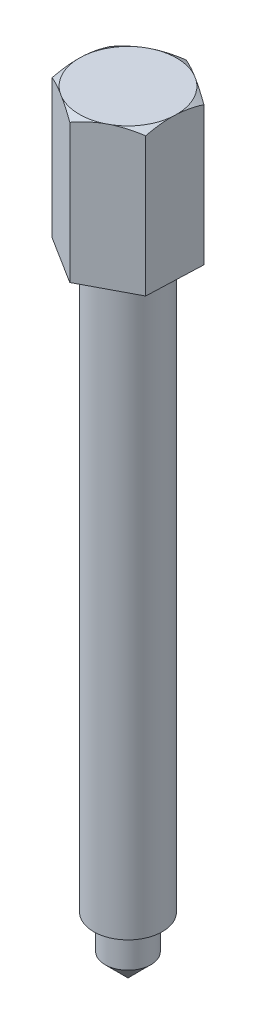
ISO-10303-21;
HEADER;
FILE_DESCRIPTION(('STEP AP214'),'2;1');
FILE_NAME('part.step','',(''),(''),'','','');
FILE_SCHEMA(('AUTOMOTIVE_DESIGN { 1 0 10303 214 1 1 1 1 }'));
ENDSEC;
DATA;
#1=APPLICATION_CONTEXT('core data for automotive mechanical design processes');
#2=APPLICATION_PROTOCOL_DEFINITION('international standard','automotive_design',2000,#1);
#3=PRODUCT_CONTEXT('',#1,'mechanical');
#4=PRODUCT('Part','Part','',(#3));
#5=PRODUCT_RELATED_PRODUCT_CATEGORY('part','',(#4));
#6=PRODUCT_DEFINITION_FORMATION('','',#4);
#7=PRODUCT_DEFINITION_CONTEXT('part definition',#1,'design');
#8=PRODUCT_DEFINITION('design','',#6,#7);
#9=PRODUCT_DEFINITION_SHAPE('','',#8);
#10=(LENGTH_UNIT() NAMED_UNIT(*) SI_UNIT(.MILLI.,.METRE.));
#11=(NAMED_UNIT(*) PLANE_ANGLE_UNIT() SI_UNIT($,.RADIAN.));
#12=(NAMED_UNIT(*) SI_UNIT($,.STERADIAN.) SOLID_ANGLE_UNIT());
#13=UNCERTAINTY_MEASURE_WITH_UNIT(LENGTH_MEASURE(1.E-05),#10,'distance_accuracy_value','');
#14=(GEOMETRIC_REPRESENTATION_CONTEXT(3) GLOBAL_UNCERTAINTY_ASSIGNED_CONTEXT((#13)) GLOBAL_UNIT_ASSIGNED_CONTEXT((#10,
#11,#12)) REPRESENTATION_CONTEXT('',''));
#15=CARTESIAN_POINT('',(0.,0.,0.));
#16=DIRECTION('',(0.,0.,1.));
#17=DIRECTION('',(1.,0.,0.));
#18=AXIS2_PLACEMENT_3D('',#15,#16,#17);
#19=CARTESIAN_POINT('',(0.,-110.,0.));
#20=DIRECTION('',(0.,1.,0.));
#21=DIRECTION('',(0.,0.,1.));
#22=AXIS2_PLACEMENT_3D('',#19,#20,#21);
#23=CONICAL_SURFACE('',#22,0.,0.785398163397444);
#24=CARTESIAN_POINT('',(0.,-106.,0.));
#25=DIRECTION('',(0.,1.,0.));
#26=DIRECTION('',(0.,0.,1.));
#27=AXIS2_PLACEMENT_3D('',#24,#25,#26);
#28=CIRCLE('',#27,4.00000000000001);
#29=CARTESIAN_POINT('',(0.,-106.,4.00000000000001));
#30=VERTEX_POINT('',#29);
#31=EDGE_CURVE('E135',#30,#30,#28,.T.);
#32=ORIENTED_EDGE('',*,*,#31,.F.);
#33=EDGE_LOOP('',(#32));
#34=FACE_BOUND('',#33,.T.);
#35=CARTESIAN_POINT('',(0.,-110.,0.));
#36=VERTEX_POINT('',#35);
#37=VERTEX_LOOP('',#36);
#38=FACE_BOUND('',#37,.T.);
#39=ADVANCED_FACE('F35',(#34,#38),#23,.T.);
#40=CARTESIAN_POINT('',(0.,0.,0.));
#41=DIRECTION('',(0.,1.,0.));
#42=DIRECTION('',(0.,0.,1.));
#43=AXIS2_PLACEMENT_3D('',#40,#41,#42);
#44=CYLINDRICAL_SURFACE('',#43,4.00000000000001);
#45=CARTESIAN_POINT('',(0.,-100.,0.));
#46=DIRECTION('',(0.,1.,0.));
#47=DIRECTION('',(0.,0.,1.));
#48=AXIS2_PLACEMENT_3D('',#45,#46,#47);
#49=CIRCLE('',#48,4.00000000000001);
#50=CARTESIAN_POINT('',(0.,-100.,4.00000000000001));
#51=VERTEX_POINT('',#50);
#52=EDGE_CURVE('E188',#51,#51,#49,.T.);
#53=ORIENTED_EDGE('',*,*,#52,.F.);
#54=EDGE_LOOP('',(#53));
#55=FACE_BOUND('',#54,.T.);
#56=ORIENTED_EDGE('',*,*,#31,.T.);
#57=EDGE_LOOP('',(#56));
#58=FACE_BOUND('',#57,.T.);
#59=ADVANCED_FACE('F193',(#55,#58),#44,.T.);
#60=CARTESIAN_POINT('',(4.00000000000001,-100.,0.));
#61=DIRECTION('',(0.,1.,0.));
#62=DIRECTION('',(0.,0.,1.));
#63=AXIS2_PLACEMENT_3D('',#60,#61,#62);
#64=PLANE('',#63);
#65=CARTESIAN_POINT('',(0.,-100.,0.));
#66=DIRECTION('',(0.,1.,0.));
#67=DIRECTION('',(0.,0.,1.));
#68=AXIS2_PLACEMENT_3D('',#65,#66,#67);
#69=CIRCLE('',#68,6.);
#70=CARTESIAN_POINT('',(0.,-100.,6.));
#71=VERTEX_POINT('',#70);
#72=EDGE_CURVE('E185',#71,#71,#69,.T.);
#73=ORIENTED_EDGE('',*,*,#72,.F.);
#74=EDGE_LOOP('',(#73));
#75=FACE_BOUND('',#74,.T.);
#76=ORIENTED_EDGE('',*,*,#52,.T.);
#77=EDGE_LOOP('',(#76));
#78=FACE_BOUND('',#77,.T.);
#79=ADVANCED_FACE('F200',(#75,#78),#64,.F.);
#80=CARTESIAN_POINT('',(0.,0.,0.));
#81=DIRECTION('',(0.,1.,0.));
#82=DIRECTION('',(0.,0.,1.));
#83=AXIS2_PLACEMENT_3D('',#80,#81,#82);
#84=CYLINDRICAL_SURFACE('',#83,6.);
#85=CARTESIAN_POINT('',(0.,0.,0.));
#86=DIRECTION('',(0.,1.,0.));
#87=DIRECTION('',(0.,0.,1.));
#88=AXIS2_PLACEMENT_3D('',#85,#86,#87);
#89=CIRCLE('',#88,6.);
#90=CARTESIAN_POINT('',(0.,0.,6.));
#91=VERTEX_POINT('',#90);
#92=EDGE_CURVE('E182',#91,#91,#89,.T.);
#93=ORIENTED_EDGE('',*,*,#92,.F.);
#94=EDGE_LOOP('',(#93));
#95=FACE_BOUND('',#94,.T.);
#96=ORIENTED_EDGE('',*,*,#72,.T.);
#97=EDGE_LOOP('',(#96));
#98=FACE_BOUND('',#97,.T.);
#99=ADVANCED_FACE('F205',(#95,#98),#84,.T.);
#100=CARTESIAN_POINT('',(0.,0.,0.));
#101=DIRECTION('',(0.,1.,0.));
#102=DIRECTION('',(0.,0.,1.));
#103=AXIS2_PLACEMENT_3D('',#100,#101,#102);
#104=PLANE('',#103);
#105=DIRECTION('',(0.884127698716343,0.,-0.467245344934054));
#106=VECTOR('',#105,1.);
#107=CARTESIAN_POINT('',(-0.367251169301559,0.,9.80808135732876));
#108=LINE('',#107,#106);
#109=CARTESIAN_POINT('',(-0.367251169301559,0.,9.80808135732876));
#110=VERTEX_POINT('',#109);
#111=CARTESIAN_POINT('',(8.31042203318048,0.,5.22208952084907));
#112=VERTEX_POINT('',#111);
#113=EDGE_CURVE('E154',#110,#112,#108,.T.);
#114=ORIENTED_EDGE('',*,*,#113,.F.);
#115=DIRECTION('',(0.846710187871085,0.,0.5320543748108));
#116=VECTOR('',#115,1.);
#117=CARTESIAN_POINT('',(-8.67767320248205,0.,4.58599183647969));
#118=LINE('',#117,#116);
#119=CARTESIAN_POINT('',(-8.67767320248205,0.,4.58599183647969));
#120=VERTEX_POINT('',#119);
#121=EDGE_CURVE('E170',#120,#110,#118,.T.);
#122=ORIENTED_EDGE('',*,*,#121,.F.);
#123=DIRECTION('',(-0.0374175108452577,0.,0.999299719744855));
#124=VECTOR('',#123,1.);
#125=CARTESIAN_POINT('',(-8.31042203318049,0.,-5.22208952084907));
#126=LINE('',#125,#124);
#127=CARTESIAN_POINT('',(-8.31042203318049,0.,-5.22208952084907));
#128=VERTEX_POINT('',#127);
#129=EDGE_CURVE('E167',#128,#120,#126,.T.);
#130=ORIENTED_EDGE('',*,*,#129,.F.);
#131=DIRECTION('',(-0.884127698716343,0.,0.467245344934054));
#132=VECTOR('',#131,1.);
#133=CARTESIAN_POINT('',(0.36725116930156,0.,-9.80808135732876));
#134=LINE('',#133,#132);
#135=CARTESIAN_POINT('',(0.36725116930156,0.,-9.80808135732876));
#136=VERTEX_POINT('',#135);
#137=EDGE_CURVE('E164',#136,#128,#134,.T.);
#138=ORIENTED_EDGE('',*,*,#137,.F.);
#139=DIRECTION('',(-0.846710187871085,0.,-0.5320543748108));
#140=VECTOR('',#139,1.);
#141=CARTESIAN_POINT('',(8.67767320248205,0.,-4.58599183647969));
#142=LINE('',#141,#140);
#143=CARTESIAN_POINT('',(8.67767320248205,0.,-4.58599183647969));
#144=VERTEX_POINT('',#143);
#145=EDGE_CURVE('E161',#144,#136,#142,.T.);
#146=ORIENTED_EDGE('',*,*,#145,.F.);
#147=DIRECTION('',(0.0374175108452579,0.,-0.999299719744855));
#148=VECTOR('',#147,1.);
#149=CARTESIAN_POINT('',(8.31042203318048,0.,5.22208952084907));
#150=LINE('',#149,#148);
#151=EDGE_CURVE('E157',#112,#144,#150,.T.);
#152=ORIENTED_EDGE('',*,*,#151,.F.);
#153=EDGE_LOOP('',(#114,#122,#130,#138,#146,#152));
#154=FACE_BOUND('',#153,.T.);
#155=ORIENTED_EDGE('',*,*,#92,.T.);
#156=EDGE_LOOP('',(#155));
#157=FACE_BOUND('',#156,.T.);
#158=ADVANCED_FACE('F212',(#154,#157),#104,.F.);
#159=CARTESIAN_POINT('',(-0.367251169301559,25.,9.80808135732876));
#160=DIRECTION('',(-0.467245344934054,0.,-0.884127698716343));
#161=DIRECTION('',(-0.884127698716343,0.,0.467245344934054));
#162=AXIS2_PLACEMENT_3D('',#159,#160,#161);
#163=PLANE('',#162);
#164=DIRECTION('',(0.,-1.,0.));
#165=VECTOR('',#164,1.);
#166=CARTESIAN_POINT('',(8.31042203318048,25.,5.22208952084907));
#167=LINE('',#166,#165);
#168=CARTESIAN_POINT('',(8.31042203318048,24.2509679461587,5.22208952084907));
#169=VERTEX_POINT('',#168);
#170=EDGE_CURVE('E180',#169,#112,#167,.T.);
#171=ORIENTED_EDGE('',*,*,#170,.F.);
#172=CARTESIAN_POINT('',(14.23008146796,21.6134464981425,2.09365760031145));
#173=CARTESIAN_POINT('',(13.958045040196,21.7567201626429,2.2374238851024));
#174=CARTESIAN_POINT('',(13.6853472492561,21.8984125852793,2.38153968825556));
#175=CARTESIAN_POINT('',(13.138350068003,22.1778905995682,2.67061771058608));
#176=CARTESIAN_POINT('',(12.8640504735478,22.31567567954,2.81558003764877));
#177=CARTESIAN_POINT('',(12.3127278289662,22.5870066228706,3.1069439883671));
#178=CARTESIAN_POINT('',(12.0356987600788,22.7205368914338,3.253348792828));
#179=CARTESIAN_POINT('',(11.4795359966391,22.981854701103,3.54727065798408));
#180=CARTESIAN_POINT('',(11.2004023715816,23.1096424308725,3.6947876819525));
#181=CARTESIAN_POINT('',(10.632918518098,23.3612216467205,3.99469253647794));
#182=CARTESIAN_POINT('',(10.3445086310598,23.4848417964861,4.14711189552212));
#183=CARTESIAN_POINT('',(9.76475332902973,23.723036886835,4.4535019865324));
#184=CARTESIAN_POINT('',(9.47340777006291,23.8376113813312,4.6074727945866));
#185=CARTESIAN_POINT('',(8.8877328231352,24.0554790897805,4.91699130983477));
#186=CARTESIAN_POINT('',(8.59340675687992,24.1587836144598,5.07253726156799));
#187=CARTESIAN_POINT('',(8.00129983193139,24.3516767374282,5.38545495975468));
#188=CARTESIAN_POINT('',(7.70351943168274,24.4412671338927,5.54282646392856));
#189=CARTESIAN_POINT('',(6.98981299009566,24.6348673712812,5.92000728629753));
#190=CARTESIAN_POINT('',(6.57221182667769,24.7313104672817,6.14070187592456));
#191=CARTESIAN_POINT('',(5.94165225828948,24.8460498697153,6.47394109403839));
#192=CARTESIAN_POINT('',(5.73078344959806,24.8793078788088,6.58538140904708));
#193=CARTESIAN_POINT('',(5.3079141714548,24.9350074534465,6.80886010111264));
#194=CARTESIAN_POINT('',(5.0959137104453,24.9574490995691,6.92089847370789));
#195=CARTESIAN_POINT('',(4.67359518598364,24.9906721042974,7.14408610250928));
#196=CARTESIAN_POINT('',(4.46328505878661,25.0015819161049,7.2552311645495));
#197=CARTESIAN_POINT('',(4.04244497743081,25.0118602315472,7.47763746316525));
#198=CARTESIAN_POINT('',(3.83191502657274,25.0112289060522,7.58889869799643));
#199=CARTESIAN_POINT('',(3.41111373719411,24.9984426605916,7.81128449576057));
#200=CARTESIAN_POINT('',(3.20084242049154,24.9862868273571,7.92240904716314));
#201=CARTESIAN_POINT('',(2.78103858454432,24.9508175457841,8.1442677090019));
#202=CARTESIAN_POINT('',(2.57150609874195,24.9275035987556,8.25500180176448));
#203=CARTESIAN_POINT('',(2.07202145229629,24.8592101441147,8.51897031701019));
#204=CARTESIAN_POINT('',(1.78258955002146,24.809326531446,8.67192979244533));
#205=CARTESIAN_POINT('',(1.2065981237362,24.6915931282489,8.9763307438514));
#206=CARTESIAN_POINT('',(0.920039115418979,24.6237401700424,9.12777194728789));
#207=CARTESIAN_POINT('',(0.349829451423951,24.4726478890242,9.42911734289637));
#208=CARTESIAN_POINT('',(0.066182116230964,24.3893926993361,9.57901978025276));
#209=CARTESIAN_POINT('',(-0.497896061445979,24.2101012414723,9.87712479730074));
#210=CARTESIAN_POINT('',(-0.778327017331667,24.1140654254245,10.0253274369231));
#211=CARTESIAN_POINT('',(-1.33927291589172,23.9103488504353,10.321777101652));
#212=CARTESIAN_POINT('',(-1.61975433385269,23.8025508123706,10.4700064095598));
#213=CARTESIAN_POINT('',(-2.17794131701544,23.5781622705272,10.764998037878));
#214=CARTESIAN_POINT('',(-2.45564685698478,23.4615716869073,10.9117603449536));
#215=CARTESIAN_POINT('',(-3.00845401290608,23.221267833346,11.2039088328083));
#216=CARTESIAN_POINT('',(-3.28355696452987,23.0975584768077,11.3492957194656));
#217=CARTESIAN_POINT('',(-3.83162198360505,22.8442510833074,11.6389380745868));
#218=CARTESIAN_POINT('',(-4.10458409920174,22.7146531792208,11.7831935684946));
#219=CARTESIAN_POINT('',(-4.53768803813697,22.5044507540349,12.0120810919077));
#220=CARTESIAN_POINT('',(-4.69843176480083,22.4254253661981,12.0970312163299));
#221=CARTESIAN_POINT('',(-5.0193206199031,22.2658464340459,12.2666151169422));
#222=CARTESIAN_POINT('',(-5.17946576312877,22.1852929277835,12.3512489009472));
#223=CARTESIAN_POINT('',(-5.49777227070982,22.0235459722286,12.5194680780473));
#224=CARTESIAN_POINT('',(-5.65593851901029,21.9423648033225,12.6030560522182));
#225=CARTESIAN_POINT('',(-5.97178148510172,21.7787854513883,12.7699732926244));
#226=CARTESIAN_POINT('',(-6.12945819512396,21.6963872491647,12.853302554754));
#227=CARTESIAN_POINT('',(-6.28691060408106,21.6134464981425,12.9365132778664));
#228=B_SPLINE_CURVE_WITH_KNOTS('',3,(#172,#173,#174,#175,#176,#177,#178,#179,#180,#181,#182,
#183,#184,#185,#186,#187,#188,#189,#190,#191,#192,#193,#194,#195,#196,#197,#198,#199,#200,#201,
#202,#203,#204,#205,#206,#207,#208,#209,#210,#211,#212,#213,#214,#215,#216,#217,#218,#219,#220,
#221,#222,#223,#224,#225,#226,#227),.UNSPECIFIED.,.F.,.F.,(4,2,2,2,2,2,2,2,2,2,2,2,2,2,2,2,2,2,
2,2,2,2,2,2,2,2,2,4),(0.,1.01824471648429,2.03662216579151,3.05838099851981,4.08010623810476,
5.12653610938958,6.17301755323939,7.21843887711766,8.26372300931769,9.70833631858575,
10.4305705005381,11.1527993019994,11.8668955684394,12.5809812624648,13.2951235495162,
14.0092977567313,15.0021206417538,15.9951186605468,16.9891453881008,17.9831369602759,
18.9881464637671,19.9931650943948,20.997636418399,22.0020850876819,22.5968063520527,
23.1915128261642,23.7808680617845,24.3702326028542),.UNSPECIFIED.);
#229=CARTESIAN_POINT('',(4.45534998710913,25.,7.25942470503963));
#230=VERTEX_POINT('',#229);
#231=EDGE_CURVE('E229',#169,#230,#228,.T.);
#232=ORIENTED_EDGE('',*,*,#231,.T.);
#233=DIRECTION('',(0.884127698716343,0.,-0.467245344934054));
#234=VECTOR('',#233,1.);
#235=CARTESIAN_POINT('',(-0.367251169301559,25.,9.80808135732876));
#236=LINE('',#235,#234);
#237=CARTESIAN_POINT('',(3.48782087676979,25.,7.7707461731382));
#238=VERTEX_POINT('',#237);
#239=EDGE_CURVE('E171',#238,#230,#236,.T.);
#240=ORIENTED_EDGE('',*,*,#239,.F.);
#241=CARTESIAN_POINT('',(-0.367251169301493,24.2509679461587,9.8080813573288));
#242=VERTEX_POINT('',#241);
#243=EDGE_CURVE('E129',#238,#242,#228,.T.);
#244=ORIENTED_EDGE('',*,*,#243,.T.);
#245=DIRECTION('',(0.,-1.,0.));
#246=VECTOR('',#245,1.);
#247=CARTESIAN_POINT('',(-0.367251169301559,25.,9.80808135732876));
#248=LINE('',#247,#246);
#249=EDGE_CURVE('E142',#242,#110,#248,.T.);
#250=ORIENTED_EDGE('',*,*,#249,.T.);
#251=ORIENTED_EDGE('',*,*,#113,.T.);
#252=EDGE_LOOP('',(#171,#232,#240,#244,#250,#251));
#253=FACE_BOUND('',#252,.T.);
#254=ADVANCED_FACE('F214',(#253),#163,.F.);
#255=CARTESIAN_POINT('',(8.31042203318048,25.,5.22208952084907));
#256=DIRECTION('',(-0.999299719744855,0.,-0.0374175108452579));
#257=DIRECTION('',(-0.0374175108452579,0.,0.999299719744855));
#258=AXIS2_PLACEMENT_3D('',#255,#256,#257);
#259=PLANE('',#258);
#260=DIRECTION('',(0.,-1.,0.));
#261=VECTOR('',#260,1.);
#262=CARTESIAN_POINT('',(8.67767320248205,25.,-4.58599183647969));
#263=LINE('',#262,#261);
#264=CARTESIAN_POINT('',(8.67767320248205,24.2509679461587,-4.58599183647969));
#265=VERTEX_POINT('',#264);
#266=EDGE_CURVE('E178',#265,#144,#263,.T.);
#267=ORIENTED_EDGE('',*,*,#266,.F.);
#268=CARTESIAN_POINT('',(8.89932734360164,21.9684892541115,-10.5056512712592));
#269=CARTESIAN_POINT('',(8.8878330195287,22.1079755046752,-10.1986753510212));
#270=CARTESIAN_POINT('',(8.87630734672953,22.2456516422068,-9.89086220851374));
#271=CARTESIAN_POINT('',(8.85317987246457,22.5165057220498,-9.2732027750212));
#272=CARTESIAN_POINT('',(8.84157805773964,22.6496828546842,-8.96335612992761));
#273=CARTESIAN_POINT('',(8.81824063835403,22.9111519322656,-8.34008974676143));
#274=CARTESIAN_POINT('',(8.80650467823718,23.0394213036161,-8.02666051561333));
#275=CARTESIAN_POINT('',(8.78293378822296,23.2892748220069,-7.39715889315753));
#276=CARTESIAN_POINT('',(8.77109886288073,23.4108592748084,-7.08108662350276));
#277=CARTESIAN_POINT('',(8.74736688234484,23.6453460810252,-6.44728279842793));
#278=CARTESIAN_POINT('',(8.73547031817304,23.7582837533503,-6.1295643566008));
#279=CARTESIAN_POINT('',(8.71155019630785,23.9742323054342,-5.49073589003052));
#280=CARTESIAN_POINT('',(8.69952663236659,24.0772426942647,-5.16962569842754));
#281=CARTESIAN_POINT('',(8.6753585643771,24.2709843366448,-4.52417539927351));
#282=CARTESIAN_POINT('',(8.66321424669335,24.3617320717289,-4.19984026891017));
#283=CARTESIAN_POINT('',(8.63878378905808,24.5285444621306,-3.54738239780455));
#284=CARTESIAN_POINT('',(8.62649765526631,24.604609752653,-3.21925982156923));
#285=CARTESIAN_POINT('',(8.60529609412779,24.7201744686324,-2.65303524849445));
#286=CARTESIAN_POINT('',(8.59641310062015,24.7639257458191,-2.41579945375155));
#287=CARTESIAN_POINT('',(8.57858733591138,24.8414642205575,-1.9397313969696));
#288=CARTESIAN_POINT('',(8.56964457483535,24.8752530641578,-1.70089940533943));
#289=CARTESIAN_POINT('',(8.55171232537411,24.9319866136287,-1.22198748799891));
#290=CARTESIAN_POINT('',(8.54272284598787,24.954933334975,-0.981907802621919));
#291=CARTESIAN_POINT('',(8.52471286491765,24.989327519048,-0.500919927439193));
#292=CARTESIAN_POINT('',(8.51569236330971,25.0007750099461,-0.260011739664619));
#293=CARTESIAN_POINT('',(8.49764603945813,25.0118141243827,0.221946732717401));
#294=CARTESIAN_POINT('',(8.48862022281094,25.0114122195661,0.462996867861381));
#295=CARTESIAN_POINT('',(8.47058035455807,24.9987814645754,0.944782932249304));
#296=CARTESIAN_POINT('',(8.46156630289356,24.9865526737625,1.18551886306422));
#297=CARTESIAN_POINT('',(8.44356959354593,24.9506418567218,1.66615229380709));
#298=CARTESIAN_POINT('',(8.43458693888826,24.9269587558086,1.90604971293512));
#299=CARTESIAN_POINT('',(8.41667080933342,24.8688222428595,2.38453112013253));
#300=CARTESIAN_POINT('',(8.40773733650779,24.8343683806365,2.6231150528777));
#301=CARTESIAN_POINT('',(8.38541172355219,24.7355706926955,3.21935938516194));
#302=CARTESIAN_POINT('',(8.37205839120149,24.6649323009791,3.57598335544421));
#303=CARTESIAN_POINT('',(8.34551247310785,24.504640128335,4.28493827820888));
#304=CARTESIAN_POINT('',(8.3323199246886,24.4149820179255,4.6372682338972));
#305=CARTESIAN_POINT('',(8.30606900893404,24.2198580903541,5.33834460600163));
#306=CARTESIAN_POINT('',(8.29301101213571,24.1143570132263,5.68708112658341));
#307=CARTESIAN_POINT('',(8.2670497772868,23.8907217022373,6.38042106616491));
#308=CARTESIAN_POINT('',(8.25414652826015,23.7725883703323,6.72502477830008));
#309=CARTESIAN_POINT('',(8.22832619180969,23.5247259967195,7.41460178103986));
#310=CARTESIAN_POINT('',(8.2154107288238,23.3948768452057,7.75953168820437));
#311=CARTESIAN_POINT('',(8.18970113593146,23.12684226972,8.44615109157177));
#312=CARTESIAN_POINT('',(8.176907013807,22.9886563152106,8.78784037994355));
#313=CARTESIAN_POINT('',(8.15150398470814,22.7064851294293,9.46627246389853));
#314=CARTESIAN_POINT('',(8.13889441804817,22.5625421186309,9.80303287753268));
#315=CARTESIAN_POINT('',(8.11376692922506,22.2692678524223,10.474106179086));
#316=CARTESIAN_POINT('',(8.10124898498367,22.119937950204,10.8084196566427));
#317=CARTESIAN_POINT('',(8.08876789206089,21.9684892541115,11.1417489556286));
#318=B_SPLINE_CURVE_WITH_KNOTS('',3,(#268,#269,#270,#271,#272,#273,#274,#275,#276,#277,#278,
#279,#280,#281,#282,#283,#284,#285,#286,#287,#288,#289,#290,#291,#292,#293,#294,#295,#296,#297,
#298,#299,#300,#301,#302,#303,#304,#305,#306,#307,#308,#309,#310,#311,#312,#313,#314,#315,#316,
#317),.UNSPECIFIED.,.F.,.F.,(4,2,2,2,2,2,2,2,2,2,2,2,2,2,2,2,2,2,2,2,2,2,2,2,4),(0.,
1.01214454938079,2.02447029239928,3.04099827286971,4.05747971967174,5.06955913638856,
6.08168857722682,7.09244384681807,8.10315537842976,8.827171481499,9.55106789148689,
10.2748296811265,10.9985896976527,11.7219544340205,12.4453155397132,13.1687445269682,
13.8922037555309,14.9829299094317,16.0739046135937,17.1673443883906,18.2607061425103,
19.3669359774609,20.4732362850864,21.5725375088888,22.6715644843487),.UNSPECIFIED.);
#319=CARTESIAN_POINT('',(8.51452120497925,25.,-0.228733919067361));
#320=VERTEX_POINT('',#319);
#321=EDGE_CURVE('E262',#265,#320,#318,.T.);
#322=ORIENTED_EDGE('',*,*,#321,.T.);
#323=DIRECTION('',(0.0374175108452579,0.,-0.999299719744855));
#324=VECTOR('',#323,1.);
#325=CARTESIAN_POINT('',(8.31042203318048,25.,5.22208952084907));
#326=LINE('',#325,#324);
#327=CARTESIAN_POINT('',(8.47357403068328,25.,0.864831603436744));
#328=VERTEX_POINT('',#327);
#329=EDGE_CURVE('E311',#328,#320,#326,.T.);
#330=ORIENTED_EDGE('',*,*,#329,.F.);
#331=EDGE_CURVE('E228',#328,#169,#318,.T.);
#332=ORIENTED_EDGE('',*,*,#331,.T.);
#333=ORIENTED_EDGE('',*,*,#170,.T.);
#334=ORIENTED_EDGE('',*,*,#151,.T.);
#335=EDGE_LOOP('',(#267,#322,#330,#332,#333,#334));
#336=FACE_BOUND('',#335,.T.);
#337=ADVANCED_FACE('F218',(#336),#259,.F.);
#338=CARTESIAN_POINT('',(8.67767320248205,25.,-4.58599183647969));
#339=DIRECTION('',(-0.5320543748108,0.,0.846710187871085));
#340=DIRECTION('',(0.846710187871085,0.,0.5320543748108));
#341=AXIS2_PLACEMENT_3D('',#338,#339,#340);
#342=PLANE('',#341);
#343=DIRECTION('',(0.,-1.,0.));
#344=VECTOR('',#343,1.);
#345=CARTESIAN_POINT('',(0.36725116930156,25.,-9.80808135732876));
#346=LINE('',#345,#344);
#347=CARTESIAN_POINT('',(0.367251169301561,24.2509679461587,-9.80808135732876));
#348=VERTEX_POINT('',#347);
#349=EDGE_CURVE('E176',#348,#136,#346,.T.);
#350=ORIENTED_EDGE('',*,*,#349,.F.);
#351=CARTESIAN_POINT('',(-5.55240826547794,21.4750356314565,-13.5278673535072));
#352=CARTESIAN_POINT('',(-5.29033874593188,21.62041345735,-13.3631885337925));
#353=CARTESIAN_POINT('',(-5.02765633852324,21.764273030937,-13.1981245885965));
#354=CARTESIAN_POINT('',(-4.5008072311424,22.0482449318957,-12.8670640008505));
#355=CARTESIAN_POINT('',(-4.23664035887999,22.1883568129587,-12.701067250037));
#356=CARTESIAN_POINT('',(-3.7058155392685,22.464509314633,-12.3675084106866));
#357=CARTESIAN_POINT('',(-3.43915244483176,22.6005361767778,-12.1999430878311));
#358=CARTESIAN_POINT('',(-2.90386834084035,22.8670939639406,-11.8635821305933));
#359=CARTESIAN_POINT('',(-2.6352473907416,22.9976250550445,-11.6947865335718));
#360=CARTESIAN_POINT('',(-2.08840326737112,23.255443110169,-11.3511615101026));
#361=CARTESIAN_POINT('',(-1.8101174696176,23.3825456350892,-11.1762927317845));
#362=CARTESIAN_POINT('',(-1.25077587288653,23.6280365847303,-10.8248145662711));
#363=CARTESIAN_POINT('',(-0.969719941728916,23.7464245913232,-10.6482050960167));
#364=CARTESIAN_POINT('',(-0.404747467426367,23.9723114275291,-10.2931886087861));
#365=CARTESIAN_POINT('',(-0.120833796038275,24.0798201816409,-10.1147833963598));
#366=CARTESIAN_POINT('',(0.450325556905782,24.2815395507464,-9.75587920836125));
#367=CARTESIAN_POINT('',(0.737570815431541,24.3757518344889,-9.57538049861199));
#368=CARTESIAN_POINT('',(1.42240100845676,24.5797619365752,-9.14504801245432));
#369=CARTESIAN_POINT('',(1.82156291313143,24.6824685766403,-8.89422330208446));
#370=CARTESIAN_POINT('',(2.42454323078599,24.807580734689,-8.51532350788267));
#371=CARTESIAN_POINT('',(2.62624045685718,24.8444598836388,-8.38858133204066));
#372=CARTESIAN_POINT('',(3.03080776211526,24.9076586389953,-8.13435998481771));
#373=CARTESIAN_POINT('',(3.23367767583898,24.933979699927,-8.00688091741026));
#374=CARTESIAN_POINT('',(3.6378003386911,24.9750763364305,-7.75293897386134));
#375=CARTESIAN_POINT('',(3.83904318545425,24.9899869860858,-7.62648232015208));
#376=CARTESIAN_POINT('',(4.24190395467507,25.0083420645899,-7.37333332327687));
#377=CARTESIAN_POINT('',(4.44352187065489,25.0117866896631,-7.24664098418147));
#378=CARTESIAN_POINT('',(4.84666372467685,25.0071032803624,-6.99331535969474));
#379=CARTESIAN_POINT('',(5.0481876615591,24.9989751067521,-6.86668207503226));
#380=CARTESIAN_POINT('',(5.45067869861108,24.9713957541784,-6.61376540985774));
#381=CARTESIAN_POINT('',(5.65164577435922,24.9519440862709,-6.4874820446917));
#382=CARTESIAN_POINT('',(6.12039355408527,24.8938701619657,-6.19293107499903));
#383=CARTESIAN_POINT('',(6.38779917541901,24.8509905871177,-6.0248991642961));
#384=CARTESIAN_POINT('',(6.92020307165484,24.7479065359456,-5.69034806733715));
#385=CARTESIAN_POINT('',(7.1852009762458,24.6876994396359,-5.52382911377664));
#386=CARTESIAN_POINT('',(7.71266794670803,24.5522305287258,-5.19238027422948));
#387=CARTESIAN_POINT('',(7.97513426630921,24.4769539521791,-5.02745211393958));
#388=CARTESIAN_POINT('',(8.49719039986264,24.3137208689074,-4.69940332731484));
#389=CARTESIAN_POINT('',(8.75678028536224,24.2257646783363,-4.5362826560212));
#390=CARTESIAN_POINT('',(9.27640048950174,24.0381470914599,-4.20976455477143));
#391=CARTESIAN_POINT('',(9.53639659463659,23.9383544561377,-4.04638862384213));
#392=CARTESIAN_POINT('',(10.053799706436,23.7298524882541,-3.72126369548175));
#393=CARTESIAN_POINT('',(10.3112066920463,23.6211430832489,-3.55951471128071));
#394=CARTESIAN_POINT('',(10.8235769486187,23.3964404471202,-3.23755232032647));
#395=CARTESIAN_POINT('',(11.0785413563636,23.2804508151051,-3.07733819924358));
#396=CARTESIAN_POINT('',(11.5864263926391,23.0424265457604,-2.75819422374618));
#397=CARTESIAN_POINT('',(11.8393470615097,22.9203920280875,-2.59926434398288));
#398=CARTESIAN_POINT('',(12.3037204800796,22.6909229720471,-2.30746212825997));
#399=CARTESIAN_POINT('',(12.5154316773907,22.5842153670225,-2.1744273894091));
#400=CARTESIAN_POINT('',(12.9377218567211,22.3677525825584,-1.90906937131641));
#401=CARTESIAN_POINT('',(13.1483008882862,22.2579975377985,-1.77674606094101));
#402=CARTESIAN_POINT('',(13.5657728811195,22.0372858473418,-1.51441568706611));
#403=CARTESIAN_POINT('',(13.7726785169064,21.9263625783111,-1.38440065917301));
#404=CARTESIAN_POINT('',(14.1856270881496,21.7022875687833,-1.12491270562155));
#405=CARTESIAN_POINT('',(14.3916700107577,21.5891357952394,-0.995439788036802));
#406=CARTESIAN_POINT('',(14.5973326372615,21.4750356314565,-0.866205840301274));
#407=B_SPLINE_CURVE_WITH_KNOTS('',3,(#351,#352,#353,#354,#355,#356,#357,#358,#359,#360,#361,
#362,#363,#364,#365,#366,#367,#368,#369,#370,#371,#372,#373,#374,#375,#376,#377,#378,#379,#380,
#381,#382,#383,#384,#385,#386,#387,#388,#389,#390,#391,#392,#393,#394,#395,#396,#397,#398,#399,
#400,#401,#402,#403,#404,#405,#406),.UNSPECIFIED.,.F.,.F.,(4,2,2,2,2,2,2,2,2,2,2,2,2,2,2,2,2,2,
2,2,2,2,2,2,2,2,2,4),(0.,1.02587989140028,2.05188141463851,3.0810200997184,4.11012766118854,
5.16718979817516,6.22430262065457,7.28044223962257,8.3364491916624,9.78240059960252,
10.5053588761864,11.2282175208697,11.9423807654598,12.6565317881073,13.3706914030301,
14.0848818573825,15.0404563372384,15.9961753794836,16.9528352587469,17.9094712887571,
18.8779313106013,19.8463992014282,20.8143920276739,21.7823657004416,22.5979155463032,
23.4134294066906,24.2185018625016,25.0235862658769),.UNSPECIFIED.);
#408=CARTESIAN_POINT('',(4.05917121787014,25.,-7.48815862410699));
#409=VERTEX_POINT('',#408);
#410=EDGE_CURVE('E261',#348,#409,#407,.T.);
#411=ORIENTED_EDGE('',*,*,#410,.T.);
#412=DIRECTION('',(-0.846710187871085,0.,-0.5320543748108));
#413=VECTOR('',#412,1.);
#414=CARTESIAN_POINT('',(8.67767320248205,25.,-4.58599183647969));
#415=LINE('',#414,#413);
#416=CARTESIAN_POINT('',(4.98575315391347,25.,-6.90591456970147));
#417=VERTEX_POINT('',#416);
#418=EDGE_CURVE('E299',#417,#409,#415,.T.);
#419=ORIENTED_EDGE('',*,*,#418,.F.);
#420=EDGE_CURVE('E250',#417,#265,#407,.T.);
#421=ORIENTED_EDGE('',*,*,#420,.T.);
#422=ORIENTED_EDGE('',*,*,#266,.T.);
#423=ORIENTED_EDGE('',*,*,#145,.T.);
#424=EDGE_LOOP('',(#350,#411,#419,#421,#422,#423));
#425=FACE_BOUND('',#424,.T.);
#426=ADVANCED_FACE('F273',(#425),#342,.F.);
#427=CARTESIAN_POINT('',(0.36725116930156,25.,-9.80808135732876));
#428=DIRECTION('',(0.467245344934054,0.,0.884127698716343));
#429=DIRECTION('',(0.884127698716343,0.,-0.467245344934054));
#430=AXIS2_PLACEMENT_3D('',#427,#428,#429);
#431=PLANE('',#430);
#432=DIRECTION('',(0.,-1.,0.));
#433=VECTOR('',#432,1.);
#434=CARTESIAN_POINT('',(-8.31042203318049,25.,-5.22208952084907));
#435=LINE('',#434,#433);
#436=CARTESIAN_POINT('',(-8.31042203318049,24.2509679461587,-5.22208952084907));
#437=VERTEX_POINT('',#436);
#438=EDGE_CURVE('E174',#437,#128,#435,.T.);
#439=ORIENTED_EDGE('',*,*,#438,.F.);
#440=CARTESIAN_POINT('',(-14.23008146796,21.6134464981425,-2.09365760031145));
#441=CARTESIAN_POINT('',(-13.958045040196,21.7567201626429,-2.2374238851024));
#442=CARTESIAN_POINT('',(-13.6853472492561,21.8984125852793,-2.38153968825556));
#443=CARTESIAN_POINT('',(-13.138350068003,22.1778905995682,-2.67061771058608));
#444=CARTESIAN_POINT('',(-12.8640504735478,22.31567567954,-2.81558003764877));
#445=CARTESIAN_POINT('',(-12.3127278289662,22.5870066228706,-3.10694398836709));
#446=CARTESIAN_POINT('',(-12.0356987600788,22.7205368914338,-3.253348792828));
#447=CARTESIAN_POINT('',(-11.4795359966391,22.981854701103,-3.54727065798408));
#448=CARTESIAN_POINT('',(-11.2004023715816,23.1096424308725,-3.6947876819525));
#449=CARTESIAN_POINT('',(-10.632918518098,23.3612216467205,-3.99469253647794));
#450=CARTESIAN_POINT('',(-10.3445086310598,23.4848417964861,-4.14711189552212));
#451=CARTESIAN_POINT('',(-9.76475332902974,23.723036886835,-4.4535019865324));
#452=CARTESIAN_POINT('',(-9.47340777006291,23.8376113813312,-4.6074727945866));
#453=CARTESIAN_POINT('',(-8.88773282313521,24.0554790897805,-4.91699130983477));
#454=CARTESIAN_POINT('',(-8.59340675687993,24.1587836144598,-5.07253726156799));
#455=CARTESIAN_POINT('',(-8.0012998319314,24.3516767374281,-5.38545495975468));
#456=CARTESIAN_POINT('',(-7.70351943168275,24.4412671338927,-5.54282646392856));
#457=CARTESIAN_POINT('',(-6.98981299009566,24.6348673712812,-5.92000728629753));
#458=CARTESIAN_POINT('',(-6.5722118266777,24.7313104672817,-6.14070187592456));
#459=CARTESIAN_POINT('',(-5.94165225828948,24.8460498697153,-6.47394109403839));
#460=CARTESIAN_POINT('',(-5.73078344959807,24.8793078788088,-6.58538140904708));
#461=CARTESIAN_POINT('',(-5.30791417145481,24.9350074534465,-6.80886010111264));
#462=CARTESIAN_POINT('',(-5.0959137104453,24.9574490995691,-6.92089847370789));
#463=CARTESIAN_POINT('',(-4.67359518598364,24.9906721042974,-7.14408610250928));
#464=CARTESIAN_POINT('',(-4.46328505878661,25.0015819161049,-7.2552311645495));
#465=CARTESIAN_POINT('',(-4.04244497743081,25.0118602315472,-7.47763746316525));
#466=CARTESIAN_POINT('',(-3.83191502657274,25.0112289060522,-7.58889869799643));
#467=CARTESIAN_POINT('',(-3.41111373719412,24.9984426605916,-7.81128449576057));
#468=CARTESIAN_POINT('',(-3.20084242049154,24.9862868273571,-7.92240904716313));
#469=CARTESIAN_POINT('',(-2.78103858454433,24.9508175457841,-8.1442677090019));
#470=CARTESIAN_POINT('',(-2.57150609874196,24.9275035987556,-8.25500180176448));
#471=CARTESIAN_POINT('',(-2.0720214522963,24.8592101441147,-8.51897031701019));
#472=CARTESIAN_POINT('',(-1.78258955002146,24.809326531446,-8.67192979244533));
#473=CARTESIAN_POINT('',(-1.2065981237362,24.6915931282489,-8.9763307438514));
#474=CARTESIAN_POINT('',(-0.920039115418985,24.6237401700424,-9.12777194728789));
#475=CARTESIAN_POINT('',(-0.349829451423958,24.4726478890242,-9.42911734289637));
#476=CARTESIAN_POINT('',(-0.0661821162309716,24.3893926993361,-9.57901978025275));
#477=CARTESIAN_POINT('',(0.49789606144597,24.2101012414723,-9.87712479730074));
#478=CARTESIAN_POINT('',(0.778327017331658,24.1140654254245,-10.0253274369231));
#479=CARTESIAN_POINT('',(1.33927291589171,23.9103488504353,-10.321777101652));
#480=CARTESIAN_POINT('',(1.61975433385268,23.8025508123706,-10.4700064095598));
#481=CARTESIAN_POINT('',(2.17794131701543,23.5781622705272,-10.764998037878));
#482=CARTESIAN_POINT('',(2.45564685698477,23.4615716869073,-10.9117603449536));
#483=CARTESIAN_POINT('',(3.00845401290607,23.221267833346,-11.2039088328083));
#484=CARTESIAN_POINT('',(3.28355696452986,23.0975584768077,-11.3492957194656));
#485=CARTESIAN_POINT('',(3.83162198360504,22.8442510833074,-11.6389380745868));
#486=CARTESIAN_POINT('',(4.10458409920173,22.7146531792209,-11.7831935684946));
#487=CARTESIAN_POINT('',(4.53768803813696,22.5044507540349,-12.0120810919077));
#488=CARTESIAN_POINT('',(4.69843176480082,22.4254253661981,-12.0970312163299));
#489=CARTESIAN_POINT('',(5.01932061990309,22.2658464340459,-12.2666151169422));
#490=CARTESIAN_POINT('',(5.17946576312876,22.1852929277835,-12.3512489009472));
#491=CARTESIAN_POINT('',(5.49777227070982,22.0235459722286,-12.5194680780473));
#492=CARTESIAN_POINT('',(5.65593851901028,21.9423648033225,-12.6030560522182));
#493=CARTESIAN_POINT('',(5.97178148510172,21.7787854513883,-12.7699732926244));
#494=CARTESIAN_POINT('',(6.12945819512396,21.6963872491647,-12.853302554754));
#495=CARTESIAN_POINT('',(6.28691060408106,21.6134464981425,-12.9365132778664));
#496=B_SPLINE_CURVE_WITH_KNOTS('',3,(#440,#441,#442,#443,#444,#445,#446,#447,#448,#449,#450,
#451,#452,#453,#454,#455,#456,#457,#458,#459,#460,#461,#462,#463,#464,#465,#466,#467,#468,#469,
#470,#471,#472,#473,#474,#475,#476,#477,#478,#479,#480,#481,#482,#483,#484,#485,#486,#487,#488,
#489,#490,#491,#492,#493,#494,#495),.UNSPECIFIED.,.F.,.F.,(4,2,2,2,2,2,2,2,2,2,2,2,2,2,2,2,2,2,
2,2,2,2,2,2,2,2,2,4),(0.,1.01824471648429,2.0366221657915,3.05838099851981,4.08010623810476,
5.12653610938958,6.17301755323939,7.21843887711766,8.26372300931769,9.70833631858575,
10.4305705005381,11.1527993019994,11.8668955684394,12.5809812624648,13.2951235495162,
14.0092977567313,15.0021206417537,15.9951186605468,16.9891453881008,17.9831369602759,
18.9881464637671,19.9931650943948,20.997636418399,22.0020850876819,22.5968063520527,
23.1915128261642,23.7808680617845,24.3702326028542),.UNSPECIFIED.);
#497=CARTESIAN_POINT('',(-4.45534998710911,25.,-7.25942470503965));
#498=VERTEX_POINT('',#497);
#499=EDGE_CURVE('E263',#437,#498,#496,.T.);
#500=ORIENTED_EDGE('',*,*,#499,.T.);
#501=DIRECTION('',(-0.884127698716343,0.,0.467245344934054));
#502=VECTOR('',#501,1.);
#503=CARTESIAN_POINT('',(0.36725116930156,25.,-9.80808135732876));
#504=LINE('',#503,#502);
#505=CARTESIAN_POINT('',(-3.48782087676981,25.,-7.77074617313819));
#506=VERTEX_POINT('',#505);
#507=EDGE_CURVE('E150',#506,#498,#504,.T.);
#508=ORIENTED_EDGE('',*,*,#507,.F.);
#509=EDGE_CURVE('E255',#506,#348,#496,.T.);
#510=ORIENTED_EDGE('',*,*,#509,.T.);
#511=ORIENTED_EDGE('',*,*,#349,.T.);
#512=ORIENTED_EDGE('',*,*,#137,.T.);
#513=EDGE_LOOP('',(#439,#500,#508,#510,#511,#512));
#514=FACE_BOUND('',#513,.T.);
#515=ADVANCED_FACE('F269',(#514),#431,.F.);
#516=CARTESIAN_POINT('',(-8.31042203318049,25.,-5.22208952084907));
#517=DIRECTION('',(0.999299719744855,0.,0.0374175108452577));
#518=DIRECTION('',(0.0374175108452577,0.,-0.999299719744855));
#519=AXIS2_PLACEMENT_3D('',#516,#517,#518);
#520=PLANE('',#519);
#521=DIRECTION('',(0.,-1.,0.));
#522=VECTOR('',#521,1.);
#523=CARTESIAN_POINT('',(-8.67767320248205,25.,4.58599183647969));
#524=LINE('',#523,#522);
#525=CARTESIAN_POINT('',(-8.67767320248205,24.2509679461587,4.58599183647969));
#526=VERTEX_POINT('',#525);
#527=EDGE_CURVE('E148',#526,#120,#524,.T.);
#528=ORIENTED_EDGE('',*,*,#527,.F.);
#529=CARTESIAN_POINT('',(-8.89932734360164,21.9684892541115,10.5056512712592));
#530=CARTESIAN_POINT('',(-8.8878330195287,22.1079755046752,10.1986753510211));
#531=CARTESIAN_POINT('',(-8.87630734672953,22.2456516422068,9.89086220851373));
#532=CARTESIAN_POINT('',(-8.85317987246457,22.5165057220498,9.2732027750212));
#533=CARTESIAN_POINT('',(-8.84157805773964,22.6496828546842,8.9633561299276));
#534=CARTESIAN_POINT('',(-8.81824063835403,22.9111519322656,8.34008974676143));
#535=CARTESIAN_POINT('',(-8.80650467823718,23.0394213036161,8.02666051561332));
#536=CARTESIAN_POINT('',(-8.78293378822296,23.2892748220069,7.39715889315752));
#537=CARTESIAN_POINT('',(-8.77109886288073,23.4108592748084,7.08108662350275));
#538=CARTESIAN_POINT('',(-8.74736688234484,23.6453460810252,6.44728279842792));
#539=CARTESIAN_POINT('',(-8.73547031817304,23.7582837533503,6.12956435660079));
#540=CARTESIAN_POINT('',(-8.71155019630785,23.9742323054342,5.49073589003051));
#541=CARTESIAN_POINT('',(-8.69952663236659,24.0772426942647,5.16962569842753));
#542=CARTESIAN_POINT('',(-8.6753585643771,24.2709843366448,4.5241753992735));
#543=CARTESIAN_POINT('',(-8.66321424669335,24.3617320717289,4.19984026891016));
#544=CARTESIAN_POINT('',(-8.63878378905808,24.5285444621306,3.54738239780453));
#545=CARTESIAN_POINT('',(-8.62649765526631,24.604609752653,3.21925982156921));
#546=CARTESIAN_POINT('',(-8.60529609412779,24.7201744686324,2.65303524849443));
#547=CARTESIAN_POINT('',(-8.59641310062015,24.7639257458191,2.41579945375154));
#548=CARTESIAN_POINT('',(-8.57858733591138,24.8414642205575,1.93973139696959));
#549=CARTESIAN_POINT('',(-8.56964457483535,24.8752530641578,1.70089940533941));
#550=CARTESIAN_POINT('',(-8.55171232537411,24.9319866136287,1.2219874879989));
#551=CARTESIAN_POINT('',(-8.54272284598787,24.954933334975,0.981907802621904));
#552=CARTESIAN_POINT('',(-8.52471286491765,24.989327519048,0.500919927439177));
#553=CARTESIAN_POINT('',(-8.51569236330971,25.0007750099461,0.260011739664604));
#554=CARTESIAN_POINT('',(-8.49764603945813,25.0118141243827,-0.221946732717416));
#555=CARTESIAN_POINT('',(-8.48862022281094,25.0114122195661,-0.462996867861396));
#556=CARTESIAN_POINT('',(-8.47058035455807,24.9987814645754,-0.944782932249319));
#557=CARTESIAN_POINT('',(-8.46156630289356,24.9865526737625,-1.18551886306424));
#558=CARTESIAN_POINT('',(-8.44356959354593,24.9506418567218,-1.6661522938071));
#559=CARTESIAN_POINT('',(-8.43458693888826,24.9269587558086,-1.90604971293513));
#560=CARTESIAN_POINT('',(-8.41667080933342,24.8688222428595,-2.38453112013255));
#561=CARTESIAN_POINT('',(-8.40773733650779,24.8343683806365,-2.62311505287771));
#562=CARTESIAN_POINT('',(-8.38541172355219,24.7355706926955,-3.21935938516196));
#563=CARTESIAN_POINT('',(-8.37205839120149,24.6649323009791,-3.57598335544423));
#564=CARTESIAN_POINT('',(-8.34551247310785,24.504640128335,-4.2849382782089));
#565=CARTESIAN_POINT('',(-8.3323199246886,24.4149820179255,-4.63726823389721));
#566=CARTESIAN_POINT('',(-8.30606900893404,24.219858090354,-5.33834460600165));
#567=CARTESIAN_POINT('',(-8.29301101213571,24.1143570132263,-5.68708112658343));
#568=CARTESIAN_POINT('',(-8.2670497772868,23.8907217022373,-6.38042106616493));
#569=CARTESIAN_POINT('',(-8.25414652826015,23.7725883703323,-6.72502477830009));
#570=CARTESIAN_POINT('',(-8.22832619180969,23.5247259967195,-7.41460178103988));
#571=CARTESIAN_POINT('',(-8.2154107288238,23.3948768452056,-7.75953168820438));
#572=CARTESIAN_POINT('',(-8.18970113593146,23.12684226972,-8.44615109157178));
#573=CARTESIAN_POINT('',(-8.176907013807,22.9886563152106,-8.78784037994356));
#574=CARTESIAN_POINT('',(-8.15150398470814,22.7064851294293,-9.46627246389853));
#575=CARTESIAN_POINT('',(-8.13889441804817,22.5625421186309,-9.80303287753269));
#576=CARTESIAN_POINT('',(-8.11376692922506,22.2692678524223,-10.474106179086));
#577=CARTESIAN_POINT('',(-8.10124898498368,22.119937950204,-10.8084196566427));
#578=CARTESIAN_POINT('',(-8.08876789206089,21.9684892541115,-11.1417489556286));
#579=B_SPLINE_CURVE_WITH_KNOTS('',3,(#529,#530,#531,#532,#533,#534,#535,#536,#537,#538,#539,
#540,#541,#542,#543,#544,#545,#546,#547,#548,#549,#550,#551,#552,#553,#554,#555,#556,#557,#558,
#559,#560,#561,#562,#563,#564,#565,#566,#567,#568,#569,#570,#571,#572,#573,#574,#575,#576,#577,
#578),.UNSPECIFIED.,.F.,.F.,(4,2,2,2,2,2,2,2,2,2,2,2,2,2,2,2,2,2,2,2,2,2,2,2,4),(0.,
1.01214454938079,2.02447029239928,3.04099827286971,4.05747971967175,5.06955913638857,
6.08168857722682,7.09244384681808,8.10315537842976,8.82717148149901,9.5510678914869,
10.2748296811265,10.9985896976527,11.7219544340205,12.4453155397132,13.1687445269682,
13.8922037555309,14.9829299094317,16.0739046135937,17.1673443883907,18.2607061425103,
19.3669359774609,20.4732362850864,21.5725375088888,22.6715644843487),.UNSPECIFIED.);
#580=CARTESIAN_POINT('',(-8.51452120497925,25.,0.228733919067337));
#581=VERTEX_POINT('',#580);
#582=EDGE_CURVE('E158',#526,#581,#579,.T.);
#583=ORIENTED_EDGE('',*,*,#582,.T.);
#584=DIRECTION('',(-0.0374175108452577,0.,0.999299719744855));
#585=VECTOR('',#584,1.);
#586=CARTESIAN_POINT('',(-8.31042203318049,25.,-5.22208952084907));
#587=LINE('',#586,#585);
#588=CARTESIAN_POINT('',(-8.47357403068329,25.,-0.864831603436718));
#589=VERTEX_POINT('',#588);
#590=EDGE_CURVE('E146',#589,#581,#587,.T.);
#591=ORIENTED_EDGE('',*,*,#590,.F.);
#592=EDGE_CURVE('E57',#589,#437,#579,.T.);
#593=ORIENTED_EDGE('',*,*,#592,.T.);
#594=ORIENTED_EDGE('',*,*,#438,.T.);
#595=ORIENTED_EDGE('',*,*,#129,.T.);
#596=EDGE_LOOP('',(#528,#583,#591,#593,#594,#595));
#597=FACE_BOUND('',#596,.T.);
#598=ADVANCED_FACE('F272',(#597),#520,.F.);
#599=CARTESIAN_POINT('',(-8.67767320248205,25.,4.58599183647969));
#600=DIRECTION('',(0.5320543748108,0.,-0.846710187871085));
#601=DIRECTION('',(-0.846710187871085,0.,-0.5320543748108));
#602=AXIS2_PLACEMENT_3D('',#599,#600,#601);
#603=PLANE('',#602);
#604=ORIENTED_EDGE('',*,*,#249,.F.);
#605=CARTESIAN_POINT('',(5.55240826547794,21.4750356314565,13.5278673535072));
#606=CARTESIAN_POINT('',(5.29033874593188,21.62041345735,13.3631885337925));
#607=CARTESIAN_POINT('',(5.02765633852324,21.764273030937,13.1981245885965));
#608=CARTESIAN_POINT('',(4.50080723114241,22.0482449318957,12.8670640008505));
#609=CARTESIAN_POINT('',(4.23664035887999,22.1883568129587,12.701067250037));
#610=CARTESIAN_POINT('',(3.7058155392685,22.464509314633,12.3675084106866));
#611=CARTESIAN_POINT('',(3.43915244483176,22.6005361767778,12.1999430878311));
#612=CARTESIAN_POINT('',(2.90386834084036,22.8670939639406,11.8635821305933));
#613=CARTESIAN_POINT('',(2.63524739074161,22.9976250550445,11.6947865335718));
#614=CARTESIAN_POINT('',(2.08840326737112,23.255443110169,11.3511615101026));
#615=CARTESIAN_POINT('',(1.8101174696176,23.3825456350892,11.1762927317845));
#616=CARTESIAN_POINT('',(1.25077587288653,23.6280365847303,10.8248145662711));
#617=CARTESIAN_POINT('',(0.969719941728916,23.7464245913232,10.6482050960167));
#618=CARTESIAN_POINT('',(0.404747467426368,23.9723114275291,10.2931886087861));
#619=CARTESIAN_POINT('',(0.120833796038276,24.0798201816409,10.1147833963598));
#620=CARTESIAN_POINT('',(-0.45032555690578,24.2815395507464,9.75587920836125));
#621=CARTESIAN_POINT('',(-0.737570815431538,24.3757518344889,9.57538049861198));
#622=CARTESIAN_POINT('',(-1.42240100845675,24.5797619365752,9.14504801245432));
#623=CARTESIAN_POINT('',(-1.82156291313142,24.6824685766403,8.89422330208446));
#624=CARTESIAN_POINT('',(-2.42454323078598,24.807580734689,8.51532350788267));
#625=CARTESIAN_POINT('',(-2.62624045685718,24.8444598836388,8.38858133204066));
#626=CARTESIAN_POINT('',(-3.03080776211526,24.9076586389953,8.13435998481771));
#627=CARTESIAN_POINT('',(-3.23367767583898,24.933979699927,8.00688091741026));
#628=CARTESIAN_POINT('',(-3.6378003386911,24.9750763364305,7.75293897386134));
#629=CARTESIAN_POINT('',(-3.83904318545425,24.9899869860859,7.62648232015208));
#630=CARTESIAN_POINT('',(-4.24190395467507,25.0083420645899,7.37333332327687));
#631=CARTESIAN_POINT('',(-4.44352187065489,25.0117866896631,7.24664098418146));
#632=CARTESIAN_POINT('',(-4.84666372467684,25.0071032803624,6.99331535969474));
#633=CARTESIAN_POINT('',(-5.0481876615591,24.9989751067521,6.86668207503226));
#634=CARTESIAN_POINT('',(-5.45067869861108,24.9713957541784,6.61376540985774));
#635=CARTESIAN_POINT('',(-5.65164577435922,24.9519440862709,6.4874820446917));
#636=CARTESIAN_POINT('',(-6.12039355408527,24.8938701619657,6.19293107499903));
#637=CARTESIAN_POINT('',(-6.38779917541901,24.8509905871177,6.0248991642961));
#638=CARTESIAN_POINT('',(-6.92020307165484,24.7479065359456,5.69034806733715));
#639=CARTESIAN_POINT('',(-7.1852009762458,24.6876994396359,5.52382911377664));
#640=CARTESIAN_POINT('',(-7.71266794670803,24.5522305287259,5.19238027422948));
#641=CARTESIAN_POINT('',(-7.9751342663092,24.4769539521791,5.02745211393958));
#642=CARTESIAN_POINT('',(-8.49719039986264,24.3137208689074,4.69940332731484));
#643=CARTESIAN_POINT('',(-8.75678028536223,24.2257646783363,4.5362826560212));
#644=CARTESIAN_POINT('',(-9.27640048950174,24.0381470914599,4.20976455477143));
#645=CARTESIAN_POINT('',(-9.53639659463658,23.9383544561377,4.04638862384213));
#646=CARTESIAN_POINT('',(-10.053799706436,23.7298524882541,3.72126369548175));
#647=CARTESIAN_POINT('',(-10.3112066920463,23.6211430832489,3.55951471128071));
#648=CARTESIAN_POINT('',(-10.8235769486187,23.3964404471202,3.23755232032647));
#649=CARTESIAN_POINT('',(-11.0785413563636,23.2804508151051,3.07733819924357));
#650=CARTESIAN_POINT('',(-11.5864263926391,23.0424265457604,2.75819422374618));
#651=CARTESIAN_POINT('',(-11.8393470615097,22.9203920280875,2.59926434398288));
#652=CARTESIAN_POINT('',(-12.3037204800796,22.6909229720471,2.30746212825996));
#653=CARTESIAN_POINT('',(-12.5154316773907,22.5842153670225,2.1744273894091));
#654=CARTESIAN_POINT('',(-12.9377218567211,22.3677525825584,1.9090693713164));
#655=CARTESIAN_POINT('',(-13.1483008882862,22.2579975377985,1.77674606094101));
#656=CARTESIAN_POINT('',(-13.5657728811195,22.0372858473418,1.51441568706611));
#657=CARTESIAN_POINT('',(-13.7726785169064,21.9263625783111,1.38440065917301));
#658=CARTESIAN_POINT('',(-14.1856270881496,21.7022875687833,1.12491270562154));
#659=CARTESIAN_POINT('',(-14.3916700107577,21.5891357952394,0.995439788036795));
#660=CARTESIAN_POINT('',(-14.5973326372615,21.4750356314565,0.866205840301266));
#661=B_SPLINE_CURVE_WITH_KNOTS('',3,(#605,#606,#607,#608,#609,#610,#611,#612,#613,#614,#615,
#616,#617,#618,#619,#620,#621,#622,#623,#624,#625,#626,#627,#628,#629,#630,#631,#632,#633,#634,
#635,#636,#637,#638,#639,#640,#641,#642,#643,#644,#645,#646,#647,#648,#649,#650,#651,#652,#653,
#654,#655,#656,#657,#658,#659,#660),.UNSPECIFIED.,.F.,.F.,(4,2,2,2,2,2,2,2,2,2,2,2,2,2,2,2,2,2,
2,2,2,2,2,2,2,2,2,4),(0.,1.02587989140028,2.05188141463851,3.0810200997184,4.11012766118854,
5.16718979817516,6.22430262065457,7.28044223962258,8.3364491916624,9.78240059960252,
10.5053588761864,11.2282175208697,11.9423807654598,12.6565317881073,13.3706914030301,
14.0848818573825,15.0404563372384,15.9961753794836,16.9528352587469,17.9094712887572,
18.8779313106013,19.8463992014282,20.814392027674,21.7823657004416,22.5979155463032,
23.4134294066906,24.2185018625016,25.023586265877),.UNSPECIFIED.);
#662=CARTESIAN_POINT('',(-4.05917121787012,25.,7.488158624107));
#663=VERTEX_POINT('',#662);
#664=EDGE_CURVE('E127',#242,#663,#661,.T.);
#665=ORIENTED_EDGE('',*,*,#664,.T.);
#666=DIRECTION('',(0.846710187871085,0.,0.5320543748108));
#667=VECTOR('',#666,1.);
#668=CARTESIAN_POINT('',(-8.67767320248205,25.,4.58599183647969));
#669=LINE('',#668,#667);
#670=CARTESIAN_POINT('',(-4.98575315391349,25.,6.90591456970145));
#671=VERTEX_POINT('',#670);
#672=EDGE_CURVE('E140',#671,#663,#669,.T.);
#673=ORIENTED_EDGE('',*,*,#672,.F.);
#674=EDGE_CURVE('E49',#671,#526,#661,.T.);
#675=ORIENTED_EDGE('',*,*,#674,.T.);
#676=ORIENTED_EDGE('',*,*,#527,.T.);
#677=ORIENTED_EDGE('',*,*,#121,.T.);
#678=EDGE_LOOP('',(#604,#665,#673,#675,#676,#677));
#679=FACE_BOUND('',#678,.T.);
#680=ADVANCED_FACE('F139',(#679),#603,.F.);
#681=CARTESIAN_POINT('',(0.,25.,0.));
#682=DIRECTION('',(0.,1.,0.));
#683=DIRECTION('',(0.,0.,1.));
#684=AXIS2_PLACEMENT_3D('',#681,#682,#683);
#685=PLANE('',#684);
#686=CARTESIAN_POINT('',(0.,25.,0.));
#687=DIRECTION('',(0.,1.,0.));
#688=DIRECTION('',(0.,0.,1.));
#689=AXIS2_PLACEMENT_3D('',#686,#687,#688);
#690=CIRCLE('',#689,8.51759300247277);
#691=EDGE_CURVE('E11',#671,#581,#690,.F.);
#692=ORIENTED_EDGE('',*,*,#691,.F.);
#693=ORIENTED_EDGE('',*,*,#672,.T.);
#694=EDGE_CURVE('E38',#238,#663,#690,.F.);
#695=ORIENTED_EDGE('',*,*,#694,.F.);
#696=ORIENTED_EDGE('',*,*,#239,.T.);
#697=EDGE_CURVE('E134',#328,#230,#690,.F.);
#698=ORIENTED_EDGE('',*,*,#697,.F.);
#699=ORIENTED_EDGE('',*,*,#329,.T.);
#700=EDGE_CURVE('E300',#417,#320,#690,.F.);
#701=ORIENTED_EDGE('',*,*,#700,.F.);
#702=ORIENTED_EDGE('',*,*,#418,.T.);
#703=EDGE_CURVE('E297',#506,#409,#690,.F.);
#704=ORIENTED_EDGE('',*,*,#703,.F.);
#705=ORIENTED_EDGE('',*,*,#507,.T.);
#706=EDGE_CURVE('E43',#589,#498,#690,.F.);
#707=ORIENTED_EDGE('',*,*,#706,.F.);
#708=ORIENTED_EDGE('',*,*,#590,.T.);
#709=EDGE_LOOP('',(#692,#693,#695,#696,#698,#699,#701,#702,#704,#705,#707,#708));
#710=FACE_BOUND('',#709,.T.);
#711=ADVANCED_FACE('F144',(#710),#685,.T.);
#712=CARTESIAN_POINT('',(0.,27.0021539481555,0.));
#713=DIRECTION('',(0.,-1.,0.));
#714=DIRECTION('',(0.,0.,-1.));
#715=AXIS2_PLACEMENT_3D('',#712,#713,#714);
#716=CONICAL_SURFACE('',#715,5.04976063969277,1.0471975511966);
#717=ORIENTED_EDGE('',*,*,#694,.T.);
#718=ORIENTED_EDGE('',*,*,#664,.F.);
#719=ORIENTED_EDGE('',*,*,#243,.F.);
#720=EDGE_LOOP('',(#717,#718,#719));
#721=FACE_BOUND('',#720,.T.);
#722=ADVANCED_FACE('F126',(#721),#716,.T.);
#723=ORIENTED_EDGE('',*,*,#331,.F.);
#724=ORIENTED_EDGE('',*,*,#697,.T.);
#725=ORIENTED_EDGE('',*,*,#231,.F.);
#726=EDGE_LOOP('',(#723,#724,#725));
#727=FACE_BOUND('',#726,.T.);
#728=ADVANCED_FACE('F306',(#727),#716,.T.);
#729=ORIENTED_EDGE('',*,*,#420,.F.);
#730=ORIENTED_EDGE('',*,*,#700,.T.);
#731=ORIENTED_EDGE('',*,*,#321,.F.);
#732=EDGE_LOOP('',(#729,#730,#731));
#733=FACE_BOUND('',#732,.T.);
#734=ADVANCED_FACE('F413',(#733),#716,.T.);
#735=ORIENTED_EDGE('',*,*,#509,.F.);
#736=ORIENTED_EDGE('',*,*,#703,.T.);
#737=ORIENTED_EDGE('',*,*,#410,.F.);
#738=EDGE_LOOP('',(#735,#736,#737));
#739=FACE_BOUND('',#738,.T.);
#740=ADVANCED_FACE('F296',(#739),#716,.T.);
#741=ORIENTED_EDGE('',*,*,#592,.F.);
#742=ORIENTED_EDGE('',*,*,#706,.T.);
#743=ORIENTED_EDGE('',*,*,#499,.F.);
#744=EDGE_LOOP('',(#741,#742,#743));
#745=FACE_BOUND('',#744,.T.);
#746=ADVANCED_FACE('F242',(#745),#716,.T.);
#747=ORIENTED_EDGE('',*,*,#674,.F.);
#748=ORIENTED_EDGE('',*,*,#691,.T.);
#749=ORIENTED_EDGE('',*,*,#582,.F.);
#750=EDGE_LOOP('',(#747,#748,#749));
#751=FACE_BOUND('',#750,.T.);
#752=ADVANCED_FACE('F238',(#751),#716,.T.);
#753=CLOSED_SHELL('',(#39,#59,#79,#99,#158,#254,#337,#426,#515,#598,#680,#711,#722,#728,#734,
#740,#746,#752));
#754=MANIFOLD_SOLID_BREP('B2',#753);
#755=ADVANCED_BREP_SHAPE_REPRESENTATION('',(#18,#754),#14);
#756=SHAPE_DEFINITION_REPRESENTATION(#9,#755);
ENDSEC;
END-ISO-10303-21;
